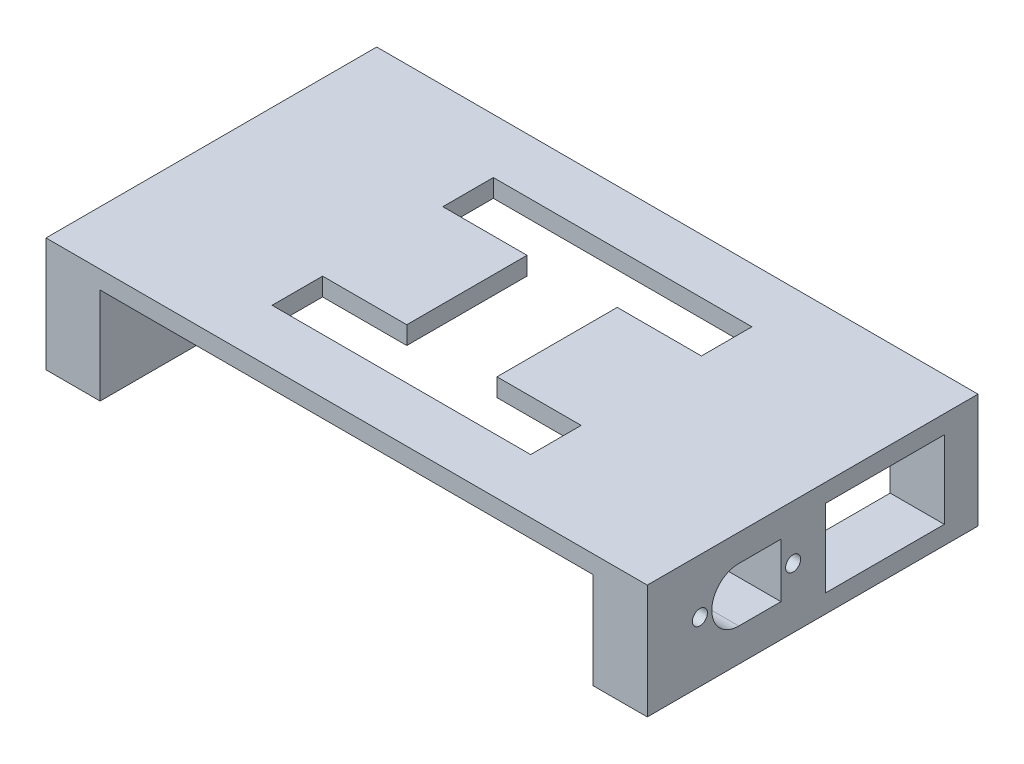
ISO-10303-21;
HEADER;
FILE_DESCRIPTION(('STEP AP214'),'2;1');
FILE_NAME('part.step','',(''),(''),'','','');
FILE_SCHEMA(('AUTOMOTIVE_DESIGN { 1 0 10303 214 1 1 1 1 }'));
ENDSEC;
DATA;
#1=APPLICATION_CONTEXT('core data for automotive mechanical design processes');
#2=APPLICATION_PROTOCOL_DEFINITION('international standard','automotive_design',2000,#1);
#3=PRODUCT_CONTEXT('',#1,'mechanical');
#4=PRODUCT('Part','Part','',(#3));
#5=PRODUCT_RELATED_PRODUCT_CATEGORY('part','',(#4));
#6=PRODUCT_DEFINITION_FORMATION('','',#4);
#7=PRODUCT_DEFINITION_CONTEXT('part definition',#1,'design');
#8=PRODUCT_DEFINITION('design','',#6,#7);
#9=PRODUCT_DEFINITION_SHAPE('','',#8);
#10=(LENGTH_UNIT() NAMED_UNIT(*) SI_UNIT(.MILLI.,.METRE.));
#11=(NAMED_UNIT(*) PLANE_ANGLE_UNIT() SI_UNIT($,.RADIAN.));
#12=(NAMED_UNIT(*) SI_UNIT($,.STERADIAN.) SOLID_ANGLE_UNIT());
#13=UNCERTAINTY_MEASURE_WITH_UNIT(LENGTH_MEASURE(1.E-05),#10,'distance_accuracy_value','');
#14=(GEOMETRIC_REPRESENTATION_CONTEXT(3) GLOBAL_UNCERTAINTY_ASSIGNED_CONTEXT((#13)) GLOBAL_UNIT_ASSIGNED_CONTEXT((#10,
#11,#12)) REPRESENTATION_CONTEXT('',''));
#15=CARTESIAN_POINT('',(0.,0.,0.));
#16=DIRECTION('',(0.,0.,1.));
#17=DIRECTION('',(1.,0.,0.));
#18=AXIS2_PLACEMENT_3D('',#15,#16,#17);
#19=CARTESIAN_POINT('',(21.5,-0.001000000000001,9.99999999999999));
#20=DIRECTION('',(0.,0.,-1.));
#21=DIRECTION('',(-1.,0.,0.));
#22=AXIS2_PLACEMENT_3D('',#19,#20,#21);
#23=PLANE('',#22);
#24=DIRECTION('',(-1.,0.,0.));
#25=VECTOR('',#24,1.);
#26=CARTESIAN_POINT('',(21.5,19.,9.99999999999999));
#27=LINE('',#26,#25);
#28=CARTESIAN_POINT('',(21.5,19.,9.99999999999999));
#29=VERTEX_POINT('',#28);
#30=CARTESIAN_POINT('',(7.5,19.,9.99999999999998));
#31=VERTEX_POINT('',#30);
#32=EDGE_CURVE('E287',#29,#31,#27,.T.);
#33=ORIENTED_EDGE('',*,*,#32,.T.);
#34=DIRECTION('',(0.,1.,0.));
#35=VECTOR('',#34,1.);
#36=CARTESIAN_POINT('',(7.5,-0.001000000000001,9.99999999999998));
#37=LINE('',#36,#35);
#38=CARTESIAN_POINT('',(7.5,16.,9.99999999999998));
#39=VERTEX_POINT('',#38);
#40=EDGE_CURVE('E271',#39,#31,#37,.T.);
#41=ORIENTED_EDGE('',*,*,#40,.F.);
#42=DIRECTION('',(1.,0.,0.));
#43=VECTOR('',#42,1.);
#44=CARTESIAN_POINT('',(21.5,16.,9.99999999999999));
#45=LINE('',#44,#43);
#46=CARTESIAN_POINT('',(21.5,16.,9.99999999999999));
#47=VERTEX_POINT('',#46);
#48=EDGE_CURVE('E234',#39,#47,#45,.T.);
#49=ORIENTED_EDGE('',*,*,#48,.T.);
#50=DIRECTION('',(0.,1.,0.));
#51=VECTOR('',#50,1.);
#52=CARTESIAN_POINT('',(21.5,-0.001000000000001,9.99999999999999));
#53=LINE('',#52,#51);
#54=EDGE_CURVE('E295',#47,#29,#53,.T.);
#55=ORIENTED_EDGE('',*,*,#54,.T.);
#56=EDGE_LOOP('',(#33,#41,#49,#55));
#57=FACE_BOUND('',#56,.T.);
#58=ADVANCED_FACE('F33',(#57),#23,.F.);
#59=CARTESIAN_POINT('',(21.5,-0.001000000000001,-9.99999999999999));
#60=DIRECTION('',(0.,0.,1.));
#61=DIRECTION('',(1.,0.,0.));
#62=AXIS2_PLACEMENT_3D('',#59,#60,#61);
#63=PLANE('',#62);
#64=DIRECTION('',(-1.,0.,0.));
#65=VECTOR('',#64,1.);
#66=CARTESIAN_POINT('',(21.5,16.,-9.99999999999999));
#67=LINE('',#66,#65);
#68=CARTESIAN_POINT('',(21.5,16.,-9.99999999999999));
#69=VERTEX_POINT('',#68);
#70=CARTESIAN_POINT('',(7.5,16.,-9.99999999999998));
#71=VERTEX_POINT('',#70);
#72=EDGE_CURVE('E232',#69,#71,#67,.T.);
#73=ORIENTED_EDGE('',*,*,#72,.T.);
#74=DIRECTION('',(0.,1.,0.));
#75=VECTOR('',#74,1.);
#76=CARTESIAN_POINT('',(7.5,-0.001000000000001,-9.99999999999998));
#77=LINE('',#76,#75);
#78=CARTESIAN_POINT('',(7.5,19.,-9.99999999999998));
#79=VERTEX_POINT('',#78);
#80=EDGE_CURVE('E215',#71,#79,#77,.T.);
#81=ORIENTED_EDGE('',*,*,#80,.T.);
#82=DIRECTION('',(1.,0.,0.));
#83=VECTOR('',#82,1.);
#84=CARTESIAN_POINT('',(21.5,19.,-9.99999999999999));
#85=LINE('',#84,#83);
#86=CARTESIAN_POINT('',(21.5,19.,-9.99999999999999));
#87=VERTEX_POINT('',#86);
#88=EDGE_CURVE('E240',#79,#87,#85,.T.);
#89=ORIENTED_EDGE('',*,*,#88,.T.);
#90=DIRECTION('',(0.,1.,0.));
#91=VECTOR('',#90,1.);
#92=CARTESIAN_POINT('',(21.5,-0.001000000000001,-9.99999999999999));
#93=LINE('',#92,#91);
#94=EDGE_CURVE('E238',#69,#87,#93,.T.);
#95=ORIENTED_EDGE('',*,*,#94,.F.);
#96=EDGE_LOOP('',(#73,#81,#89,#95));
#97=FACE_BOUND('',#96,.T.);
#98=ADVANCED_FACE('F236',(#97),#63,.F.);
#99=CARTESIAN_POINT('',(0.,0.,0.));
#100=DIRECTION('',(0.,-1.,0.));
#101=DIRECTION('',(0.,0.,-1.));
#102=AXIS2_PLACEMENT_3D('',#99,#100,#101);
#103=PLANE('',#102);
#104=DIRECTION('',(0.,0.,1.));
#105=VECTOR('',#104,1.);
#106=CARTESIAN_POINT('',(41.,0.,0.));
#107=LINE('',#106,#105);
#108=CARTESIAN_POINT('',(41.,0.,-27.5));
#109=VERTEX_POINT('',#108);
#110=CARTESIAN_POINT('',(41.,0.,27.5));
#111=VERTEX_POINT('',#110);
#112=EDGE_CURVE('E41',#109,#111,#107,.T.);
#113=ORIENTED_EDGE('',*,*,#112,.F.);
#114=DIRECTION('',(-1.,0.,0.));
#115=VECTOR('',#114,1.);
#116=CARTESIAN_POINT('',(-50.,0.,-27.5));
#117=LINE('',#116,#115);
#118=CARTESIAN_POINT('',(50.,0.,-27.5));
#119=VERTEX_POINT('',#118);
#120=EDGE_CURVE('E413',#119,#109,#117,.T.);
#121=ORIENTED_EDGE('',*,*,#120,.F.);
#122=DIRECTION('',(0.,0.,-1.));
#123=VECTOR('',#122,1.);
#124=CARTESIAN_POINT('',(50.,0.,27.5));
#125=LINE('',#124,#123);
#126=CARTESIAN_POINT('',(50.,0.,27.5));
#127=VERTEX_POINT('',#126);
#128=EDGE_CURVE('E398',#127,#119,#125,.T.);
#129=ORIENTED_EDGE('',*,*,#128,.F.);
#130=DIRECTION('',(1.,0.,0.));
#131=VECTOR('',#130,1.);
#132=CARTESIAN_POINT('',(-50.,0.,27.5));
#133=LINE('',#132,#131);
#134=EDGE_CURVE('E418',#111,#127,#133,.T.);
#135=ORIENTED_EDGE('',*,*,#134,.F.);
#136=EDGE_LOOP('',(#113,#121,#129,#135));
#137=FACE_BOUND('',#136,.T.);
#138=ADVANCED_FACE('F443',(#137),#103,.T.);
#139=CARTESIAN_POINT('',(50.,19.,27.5));
#140=DIRECTION('',(-1.,0.,0.));
#141=DIRECTION('',(0.,0.,1.));
#142=AXIS2_PLACEMENT_3D('',#139,#140,#141);
#143=PLANE('',#142);
#144=DIRECTION('',(0.,0.,1.));
#145=VECTOR('',#144,1.);
#146=CARTESIAN_POINT('',(50.,15.95,-2.10000000000003));
#147=LINE('',#146,#145);
#148=CARTESIAN_POINT('',(50.,15.95,-21.9));
#149=VERTEX_POINT('',#148);
#150=CARTESIAN_POINT('',(50.,15.95,-2.10000000000003));
#151=VERTEX_POINT('',#150);
#152=EDGE_CURVE('E313',#149,#151,#147,.T.);
#153=ORIENTED_EDGE('',*,*,#152,.F.);
#154=DIRECTION('',(0.,1.,0.));
#155=VECTOR('',#154,1.);
#156=CARTESIAN_POINT('',(50.,3.05,-21.9));
#157=LINE('',#156,#155);
#158=CARTESIAN_POINT('',(50.,3.05,-21.9));
#159=VERTEX_POINT('',#158);
#160=EDGE_CURVE('E311',#159,#149,#157,.T.);
#161=ORIENTED_EDGE('',*,*,#160,.F.);
#162=DIRECTION('',(0.,0.,-1.));
#163=VECTOR('',#162,1.);
#164=CARTESIAN_POINT('',(50.,3.05,-2.10000000000003));
#165=LINE('',#164,#163);
#166=CARTESIAN_POINT('',(50.,3.05,-2.10000000000003));
#167=VERTEX_POINT('',#166);
#168=EDGE_CURVE('E319',#167,#159,#165,.T.);
#169=ORIENTED_EDGE('',*,*,#168,.F.);
#170=DIRECTION('',(0.,-1.,0.));
#171=VECTOR('',#170,1.);
#172=CARTESIAN_POINT('',(50.,3.05,-2.10000000000003));
#173=LINE('',#172,#171);
#174=EDGE_CURVE('E316',#151,#167,#173,.T.);
#175=ORIENTED_EDGE('',*,*,#174,.F.);
#176=EDGE_LOOP('',(#153,#161,#169,#175));
#177=FACE_BOUND('',#176,.T.);
#178=CARTESIAN_POINT('',(50.,10.,3.25));
#179=DIRECTION('',(1.,0.,0.));
#180=DIRECTION('',(0.,0.,1.));
#181=AXIS2_PLACEMENT_3D('',#178,#179,#180);
#182=CIRCLE('',#181,1.25);
#183=CARTESIAN_POINT('',(50.,10.,4.5));
#184=VERTEX_POINT('',#183);
#185=EDGE_CURVE('E334',#184,#184,#182,.T.);
#186=ORIENTED_EDGE('',*,*,#185,.F.);
#187=EDGE_LOOP('',(#186));
#188=FACE_BOUND('',#187,.T.);
#189=CARTESIAN_POINT('',(50.,9.99999999999999,18.75));
#190=DIRECTION('',(1.,0.,0.));
#191=DIRECTION('',(0.,0.,-1.));
#192=AXIS2_PLACEMENT_3D('',#189,#190,#191);
#193=CIRCLE('',#192,1.24999999999999);
#194=CARTESIAN_POINT('',(50.,9.99999999999999,17.5));
#195=VERTEX_POINT('',#194);
#196=EDGE_CURVE('E335',#195,#195,#193,.T.);
#197=ORIENTED_EDGE('',*,*,#196,.F.);
#198=EDGE_LOOP('',(#197));
#199=FACE_BOUND('',#198,.T.);
#200=DIRECTION('',(0.,1.,0.));
#201=VECTOR('',#200,1.);
#202=CARTESIAN_POINT('',(50.,5.50000000000002,5.27272727272726));
#203=LINE('',#202,#201);
#204=CARTESIAN_POINT('',(50.,5.50000000000002,5.27272727272726));
#205=VERTEX_POINT('',#204);
#206=CARTESIAN_POINT('',(50.,14.5,5.27272727272729));
#207=VERTEX_POINT('',#206);
#208=EDGE_CURVE('E356',#205,#207,#203,.T.);
#209=ORIENTED_EDGE('',*,*,#208,.F.);
#210=DIRECTION('',(0.,0.,-1.));
#211=VECTOR('',#210,1.);
#212=CARTESIAN_POINT('',(50.,5.50000000000002,5.27272727272726));
#213=LINE('',#212,#211);
#214=CARTESIAN_POINT('',(50.,5.5,12.2784090909091));
#215=VERTEX_POINT('',#214);
#216=EDGE_CURVE('E354',#215,#205,#213,.T.);
#217=ORIENTED_EDGE('',*,*,#216,.F.);
#218=CARTESIAN_POINT('',(50.,10.,12.2784090909091));
#219=DIRECTION('',(1.,0.,0.));
#220=DIRECTION('',(0.,0.,1.));
#221=AXIS2_PLACEMENT_3D('',#218,#219,#220);
#222=CIRCLE('',#221,4.5);
#223=CARTESIAN_POINT('',(50.,14.5,12.2784090909091));
#224=VERTEX_POINT('',#223);
#225=EDGE_CURVE('E362',#224,#215,#222,.T.);
#226=ORIENTED_EDGE('',*,*,#225,.F.);
#227=DIRECTION('',(0.,0.,1.));
#228=VECTOR('',#227,1.);
#229=CARTESIAN_POINT('',(50.,14.5,5.27272727272729));
#230=LINE('',#229,#228);
#231=EDGE_CURVE('E359',#207,#224,#230,.T.);
#232=ORIENTED_EDGE('',*,*,#231,.F.);
#233=EDGE_LOOP('',(#209,#217,#226,#232));
#234=FACE_BOUND('',#233,.T.);
#235=ORIENTED_EDGE('',*,*,#128,.T.);
#236=DIRECTION('',(0.,-1.,0.));
#237=VECTOR('',#236,1.);
#238=CARTESIAN_POINT('',(50.,19.,-27.5));
#239=LINE('',#238,#237);
#240=CARTESIAN_POINT('',(50.,19.,-27.5));
#241=VERTEX_POINT('',#240);
#242=EDGE_CURVE('E429',#241,#119,#239,.T.);
#243=ORIENTED_EDGE('',*,*,#242,.F.);
#244=DIRECTION('',(0.,0.,-1.));
#245=VECTOR('',#244,1.);
#246=CARTESIAN_POINT('',(50.,19.,27.5));
#247=LINE('',#246,#245);
#248=CARTESIAN_POINT('',(50.,19.,27.5));
#249=VERTEX_POINT('',#248);
#250=EDGE_CURVE('E399',#249,#241,#247,.T.);
#251=ORIENTED_EDGE('',*,*,#250,.F.);
#252=DIRECTION('',(0.,-1.,0.));
#253=VECTOR('',#252,1.);
#254=CARTESIAN_POINT('',(50.,19.,27.5));
#255=LINE('',#254,#253);
#256=EDGE_CURVE('E409',#249,#127,#255,.T.);
#257=ORIENTED_EDGE('',*,*,#256,.T.);
#258=EDGE_LOOP('',(#235,#243,#251,#257));
#259=FACE_BOUND('',#258,.T.);
#260=ADVANCED_FACE('F35',(#177,#188,#199,#234,#259),#143,.F.);
#261=CARTESIAN_POINT('',(-50.,19.,-27.5));
#262=DIRECTION('',(0.,0.,1.));
#263=DIRECTION('',(1.,0.,0.));
#264=AXIS2_PLACEMENT_3D('',#261,#262,#263);
#265=PLANE('',#264);
#266=ORIENTED_EDGE('',*,*,#120,.T.);
#267=DIRECTION('',(0.,1.,0.));
#268=VECTOR('',#267,1.);
#269=CARTESIAN_POINT('',(41.,19.,-27.5));
#270=LINE('',#269,#268);
#271=CARTESIAN_POINT('',(41.,16.,-27.5));
#272=VERTEX_POINT('',#271);
#273=EDGE_CURVE('E392',#109,#272,#270,.T.);
#274=ORIENTED_EDGE('',*,*,#273,.T.);
#275=DIRECTION('',(-1.,0.,0.));
#276=VECTOR('',#275,1.);
#277=CARTESIAN_POINT('',(-50.,16.,-27.5));
#278=LINE('',#277,#276);
#279=CARTESIAN_POINT('',(-41.,16.,-27.5));
#280=VERTEX_POINT('',#279);
#281=EDGE_CURVE('E395',#272,#280,#278,.T.);
#282=ORIENTED_EDGE('',*,*,#281,.T.);
#283=DIRECTION('',(0.,-1.,0.));
#284=VECTOR('',#283,1.);
#285=CARTESIAN_POINT('',(-41.,19.,-27.5));
#286=LINE('',#285,#284);
#287=CARTESIAN_POINT('',(-41.,0.,-27.5));
#288=VERTEX_POINT('',#287);
#289=EDGE_CURVE('E386',#280,#288,#286,.T.);
#290=ORIENTED_EDGE('',*,*,#289,.T.);
#291=CARTESIAN_POINT('',(-50.,0.,-27.5));
#292=VERTEX_POINT('',#291);
#293=EDGE_CURVE('E412',#288,#292,#117,.T.);
#294=ORIENTED_EDGE('',*,*,#293,.T.);
#295=DIRECTION('',(0.,-1.,0.));
#296=VECTOR('',#295,1.);
#297=CARTESIAN_POINT('',(-50.,19.,-27.5));
#298=LINE('',#297,#296);
#299=CARTESIAN_POINT('',(-50.,19.,-27.5));
#300=VERTEX_POINT('',#299);
#301=EDGE_CURVE('E426',#300,#292,#298,.T.);
#302=ORIENTED_EDGE('',*,*,#301,.F.);
#303=DIRECTION('',(-1.,0.,0.));
#304=VECTOR('',#303,1.);
#305=CARTESIAN_POINT('',(-50.,19.,-27.5));
#306=LINE('',#305,#304);
#307=EDGE_CURVE('E402',#241,#300,#306,.T.);
#308=ORIENTED_EDGE('',*,*,#307,.F.);
#309=ORIENTED_EDGE('',*,*,#242,.T.);
#310=EDGE_LOOP('',(#266,#274,#282,#290,#294,#302,#308,#309));
#311=FACE_BOUND('',#310,.T.);
#312=ADVANCED_FACE('F465',(#311),#265,.F.);
#313=CARTESIAN_POINT('',(-50.,19.,27.5));
#314=DIRECTION('',(1.,0.,0.));
#315=DIRECTION('',(0.,0.,-1.));
#316=AXIS2_PLACEMENT_3D('',#313,#314,#315);
#317=PLANE('',#316);
#318=DIRECTION('',(0.,0.,1.));
#319=VECTOR('',#318,1.);
#320=CARTESIAN_POINT('',(-50.,0.,27.5));
#321=LINE('',#320,#319);
#322=CARTESIAN_POINT('',(-50.,0.,27.5));
#323=VERTEX_POINT('',#322);
#324=EDGE_CURVE('E416',#292,#323,#321,.T.);
#325=ORIENTED_EDGE('',*,*,#324,.T.);
#326=DIRECTION('',(0.,-1.,0.));
#327=VECTOR('',#326,1.);
#328=CARTESIAN_POINT('',(-50.,19.,27.5));
#329=LINE('',#328,#327);
#330=CARTESIAN_POINT('',(-50.,19.,27.5));
#331=VERTEX_POINT('',#330);
#332=EDGE_CURVE('E423',#331,#323,#329,.T.);
#333=ORIENTED_EDGE('',*,*,#332,.F.);
#334=DIRECTION('',(0.,0.,1.));
#335=VECTOR('',#334,1.);
#336=CARTESIAN_POINT('',(-50.,19.,27.5));
#337=LINE('',#336,#335);
#338=EDGE_CURVE('E405',#300,#331,#337,.T.);
#339=ORIENTED_EDGE('',*,*,#338,.F.);
#340=ORIENTED_EDGE('',*,*,#301,.T.);
#341=EDGE_LOOP('',(#325,#333,#339,#340));
#342=FACE_BOUND('',#341,.T.);
#343=ADVANCED_FACE('F455',(#342),#317,.F.);
#344=CARTESIAN_POINT('',(-50.,19.,27.5));
#345=DIRECTION('',(0.,0.,-1.));
#346=DIRECTION('',(-1.,0.,0.));
#347=AXIS2_PLACEMENT_3D('',#344,#345,#346);
#348=PLANE('',#347);
#349=DIRECTION('',(1.,0.,0.));
#350=VECTOR('',#349,1.);
#351=CARTESIAN_POINT('',(-50.,16.,27.5));
#352=LINE('',#351,#350);
#353=CARTESIAN_POINT('',(-41.,16.,27.5));
#354=VERTEX_POINT('',#353);
#355=CARTESIAN_POINT('',(41.,16.,27.5));
#356=VERTEX_POINT('',#355);
#357=EDGE_CURVE('E11',#354,#356,#352,.T.);
#358=ORIENTED_EDGE('',*,*,#357,.T.);
#359=DIRECTION('',(0.,-1.,0.));
#360=VECTOR('',#359,1.);
#361=CARTESIAN_POINT('',(41.,19.,27.5));
#362=LINE('',#361,#360);
#363=EDGE_CURVE('E389',#356,#111,#362,.T.);
#364=ORIENTED_EDGE('',*,*,#363,.T.);
#365=ORIENTED_EDGE('',*,*,#134,.T.);
#366=ORIENTED_EDGE('',*,*,#256,.F.);
#367=DIRECTION('',(1.,0.,0.));
#368=VECTOR('',#367,1.);
#369=CARTESIAN_POINT('',(-50.,19.,27.5));
#370=LINE('',#369,#368);
#371=EDGE_CURVE('E407',#331,#249,#370,.T.);
#372=ORIENTED_EDGE('',*,*,#371,.F.);
#373=ORIENTED_EDGE('',*,*,#332,.T.);
#374=CARTESIAN_POINT('',(-41.,0.,27.5));
#375=VERTEX_POINT('',#374);
#376=EDGE_CURVE('E403',#323,#375,#133,.T.);
#377=ORIENTED_EDGE('',*,*,#376,.T.);
#378=DIRECTION('',(0.,1.,0.));
#379=VECTOR('',#378,1.);
#380=CARTESIAN_POINT('',(-41.,19.,27.5));
#381=LINE('',#380,#379);
#382=EDGE_CURVE('E383',#375,#354,#381,.T.);
#383=ORIENTED_EDGE('',*,*,#382,.T.);
#384=EDGE_LOOP('',(#358,#364,#365,#366,#372,#373,#377,#383));
#385=FACE_BOUND('',#384,.T.);
#386=ADVANCED_FACE('F440',(#385),#348,.F.);
#387=CARTESIAN_POINT('',(0.,19.,0.));
#388=DIRECTION('',(0.,-1.,0.));
#389=DIRECTION('',(0.,0.,-1.));
#390=AXIS2_PLACEMENT_3D('',#387,#388,#389);
#391=PLANE('',#390);
#392=ORIENTED_EDGE('',*,*,#88,.F.);
#393=DIRECTION('',(0.,0.,-1.));
#394=VECTOR('',#393,1.);
#395=CARTESIAN_POINT('',(7.5,19.,9.99999999999998));
#396=LINE('',#395,#394);
#397=EDGE_CURVE('E48',#31,#79,#396,.T.);
#398=ORIENTED_EDGE('',*,*,#397,.F.);
#399=ORIENTED_EDGE('',*,*,#32,.F.);
#400=DIRECTION('',(0.,0.,-1.));
#401=VECTOR('',#400,1.);
#402=CARTESIAN_POINT('',(21.5,19.,9.99999999999999));
#403=LINE('',#402,#401);
#404=CARTESIAN_POINT('',(21.5,19.,18.4));
#405=VERTEX_POINT('',#404);
#406=EDGE_CURVE('E283',#405,#29,#403,.T.);
#407=ORIENTED_EDGE('',*,*,#406,.F.);
#408=DIRECTION('',(1.,0.,0.));
#409=VECTOR('',#408,1.);
#410=CARTESIAN_POINT('',(21.5,19.,18.4));
#411=LINE('',#410,#409);
#412=CARTESIAN_POINT('',(-21.5,19.,18.4));
#413=VERTEX_POINT('',#412);
#414=EDGE_CURVE('E280',#413,#405,#411,.T.);
#415=ORIENTED_EDGE('',*,*,#414,.F.);
#416=DIRECTION('',(0.,0.,1.));
#417=VECTOR('',#416,1.);
#418=CARTESIAN_POINT('',(-21.5,19.,10.));
#419=LINE('',#418,#417);
#420=CARTESIAN_POINT('',(-21.5,19.,10.));
#421=VERTEX_POINT('',#420);
#422=EDGE_CURVE('E278',#421,#413,#419,.T.);
#423=ORIENTED_EDGE('',*,*,#422,.F.);
#424=CARTESIAN_POINT('',(-7.5,19.,9.99999999999998));
#425=VERTEX_POINT('',#424);
#426=EDGE_CURVE('E286',#425,#421,#27,.T.);
#427=ORIENTED_EDGE('',*,*,#426,.F.);
#428=DIRECTION('',(0.,0.,1.));
#429=VECTOR('',#428,1.);
#430=CARTESIAN_POINT('',(-7.5,19.,9.99999999999998));
#431=LINE('',#430,#429);
#432=CARTESIAN_POINT('',(-7.5,19.,-9.99999999999998));
#433=VERTEX_POINT('',#432);
#434=EDGE_CURVE('E224',#433,#425,#431,.T.);
#435=ORIENTED_EDGE('',*,*,#434,.F.);
#436=CARTESIAN_POINT('',(-21.5,19.,-9.99999999999998));
#437=VERTEX_POINT('',#436);
#438=EDGE_CURVE('E243',#437,#433,#85,.T.);
#439=ORIENTED_EDGE('',*,*,#438,.F.);
#440=DIRECTION('',(0.,0.,1.));
#441=VECTOR('',#440,1.);
#442=CARTESIAN_POINT('',(-21.5,19.,-9.99999999999998));
#443=LINE('',#442,#441);
#444=CARTESIAN_POINT('',(-21.5,19.,-18.4));
#445=VERTEX_POINT('',#444);
#446=EDGE_CURVE('E256',#445,#437,#443,.T.);
#447=ORIENTED_EDGE('',*,*,#446,.F.);
#448=DIRECTION('',(-1.,0.,0.));
#449=VECTOR('',#448,1.);
#450=CARTESIAN_POINT('',(21.5,19.,-18.4));
#451=LINE('',#450,#449);
#452=CARTESIAN_POINT('',(21.5,19.,-18.4));
#453=VERTEX_POINT('',#452);
#454=EDGE_CURVE('E253',#453,#445,#451,.T.);
#455=ORIENTED_EDGE('',*,*,#454,.F.);
#456=DIRECTION('',(0.,0.,-1.));
#457=VECTOR('',#456,1.);
#458=CARTESIAN_POINT('',(21.5,19.,-9.99999999999999));
#459=LINE('',#458,#457);
#460=EDGE_CURVE('E250',#87,#453,#459,.T.);
#461=ORIENTED_EDGE('',*,*,#460,.F.);
#462=EDGE_LOOP('',(#392,#398,#399,#407,#415,#423,#427,#435,#439,#447,#455,#461));
#463=FACE_BOUND('',#462,.T.);
#464=ORIENTED_EDGE('',*,*,#250,.T.);
#465=ORIENTED_EDGE('',*,*,#307,.T.);
#466=ORIENTED_EDGE('',*,*,#338,.T.);
#467=ORIENTED_EDGE('',*,*,#371,.T.);
#468=EDGE_LOOP('',(#464,#465,#466,#467));
#469=FACE_BOUND('',#468,.T.);
#470=ADVANCED_FACE('F451',(#463,#469),#391,.F.);
#471=DIRECTION('',(0.,0.,-1.));
#472=VECTOR('',#471,1.);
#473=CARTESIAN_POINT('',(-41.,0.,0.));
#474=LINE('',#473,#472);
#475=EDGE_CURVE('E432',#375,#288,#474,.T.);
#476=ORIENTED_EDGE('',*,*,#475,.F.);
#477=ORIENTED_EDGE('',*,*,#376,.F.);
#478=ORIENTED_EDGE('',*,*,#324,.F.);
#479=ORIENTED_EDGE('',*,*,#293,.F.);
#480=EDGE_LOOP('',(#476,#477,#478,#479));
#481=FACE_BOUND('',#480,.T.);
#482=ADVANCED_FACE('F460',(#481),#103,.T.);
#483=CARTESIAN_POINT('',(0.,16.,0.));
#484=DIRECTION('',(0.,1.,0.));
#485=DIRECTION('',(0.,0.,1.));
#486=AXIS2_PLACEMENT_3D('',#483,#484,#485);
#487=PLANE('',#486);
#488=ORIENTED_EDGE('',*,*,#48,.F.);
#489=DIRECTION('',(0.,0.,1.));
#490=VECTOR('',#489,1.);
#491=CARTESIAN_POINT('',(7.5,16.,9.99999999999998));
#492=LINE('',#491,#490);
#493=EDGE_CURVE('E218',#71,#39,#492,.T.);
#494=ORIENTED_EDGE('',*,*,#493,.F.);
#495=ORIENTED_EDGE('',*,*,#72,.F.);
#496=DIRECTION('',(0.,0.,1.));
#497=VECTOR('',#496,1.);
#498=CARTESIAN_POINT('',(21.5,16.,-9.99999999999999));
#499=LINE('',#498,#497);
#500=CARTESIAN_POINT('',(21.5,16.,-18.4));
#501=VERTEX_POINT('',#500);
#502=EDGE_CURVE('E261',#501,#69,#499,.T.);
#503=ORIENTED_EDGE('',*,*,#502,.F.);
#504=DIRECTION('',(1.,0.,0.));
#505=VECTOR('',#504,1.);
#506=CARTESIAN_POINT('',(21.5,16.,-18.4));
#507=LINE('',#506,#505);
#508=CARTESIAN_POINT('',(-21.5,16.,-18.4));
#509=VERTEX_POINT('',#508);
#510=EDGE_CURVE('E303',#509,#501,#507,.T.);
#511=ORIENTED_EDGE('',*,*,#510,.F.);
#512=DIRECTION('',(0.,0.,-1.));
#513=VECTOR('',#512,1.);
#514=CARTESIAN_POINT('',(-21.5,16.,-9.99999999999998));
#515=LINE('',#514,#513);
#516=CARTESIAN_POINT('',(-21.5,16.,-9.99999999999998));
#517=VERTEX_POINT('',#516);
#518=EDGE_CURVE('E245',#517,#509,#515,.T.);
#519=ORIENTED_EDGE('',*,*,#518,.F.);
#520=CARTESIAN_POINT('',(-7.5,16.,-9.99999999999998));
#521=VERTEX_POINT('',#520);
#522=EDGE_CURVE('E241',#521,#517,#67,.T.);
#523=ORIENTED_EDGE('',*,*,#522,.F.);
#524=DIRECTION('',(0.,0.,-1.));
#525=VECTOR('',#524,1.);
#526=CARTESIAN_POINT('',(-7.5,16.,9.99999999999998));
#527=LINE('',#526,#525);
#528=CARTESIAN_POINT('',(-7.5,16.,9.99999999999998));
#529=VERTEX_POINT('',#528);
#530=EDGE_CURVE('E56',#529,#521,#527,.T.);
#531=ORIENTED_EDGE('',*,*,#530,.F.);
#532=CARTESIAN_POINT('',(-21.5,16.,10.));
#533=VERTEX_POINT('',#532);
#534=EDGE_CURVE('E272',#533,#529,#45,.T.);
#535=ORIENTED_EDGE('',*,*,#534,.F.);
#536=DIRECTION('',(0.,0.,-1.));
#537=VECTOR('',#536,1.);
#538=CARTESIAN_POINT('',(-21.5,16.,10.));
#539=LINE('',#538,#537);
#540=CARTESIAN_POINT('',(-21.5,16.,18.4));
#541=VERTEX_POINT('',#540);
#542=EDGE_CURVE('E275',#541,#533,#539,.T.);
#543=ORIENTED_EDGE('',*,*,#542,.F.);
#544=DIRECTION('',(-1.,0.,0.));
#545=VECTOR('',#544,1.);
#546=CARTESIAN_POINT('',(21.5,16.,18.4));
#547=LINE('',#546,#545);
#548=CARTESIAN_POINT('',(21.5,16.,18.4));
#549=VERTEX_POINT('',#548);
#550=EDGE_CURVE('E294',#549,#541,#547,.T.);
#551=ORIENTED_EDGE('',*,*,#550,.F.);
#552=DIRECTION('',(0.,0.,1.));
#553=VECTOR('',#552,1.);
#554=CARTESIAN_POINT('',(21.5,16.,9.99999999999999));
#555=LINE('',#554,#553);
#556=EDGE_CURVE('E269',#47,#549,#555,.T.);
#557=ORIENTED_EDGE('',*,*,#556,.F.);
#558=EDGE_LOOP('',(#488,#494,#495,#503,#511,#519,#523,#531,#535,#543,#551,#557));
#559=FACE_BOUND('',#558,.T.);
#560=DIRECTION('',(0.,0.,1.));
#561=VECTOR('',#560,1.);
#562=CARTESIAN_POINT('',(41.,16.,-45.5));
#563=LINE('',#562,#561);
#564=EDGE_CURVE('E377',#272,#356,#563,.T.);
#565=ORIENTED_EDGE('',*,*,#564,.T.);
#566=ORIENTED_EDGE('',*,*,#357,.F.);
#567=DIRECTION('',(0.,0.,-1.));
#568=VECTOR('',#567,1.);
#569=CARTESIAN_POINT('',(-41.,16.,-45.5));
#570=LINE('',#569,#568);
#571=EDGE_CURVE('E380',#354,#280,#570,.T.);
#572=ORIENTED_EDGE('',*,*,#571,.T.);
#573=ORIENTED_EDGE('',*,*,#281,.F.);
#574=EDGE_LOOP('',(#565,#566,#572,#573));
#575=FACE_BOUND('',#574,.T.);
#576=ADVANCED_FACE('F229',(#559,#575),#487,.F.);
#577=CARTESIAN_POINT('',(41.,16.,-45.5));
#578=DIRECTION('',(1.,0.,0.));
#579=DIRECTION('',(0.,0.,-1.));
#580=AXIS2_PLACEMENT_3D('',#577,#578,#579);
#581=PLANE('',#580);
#582=DIRECTION('',(0.,0.,1.));
#583=VECTOR('',#582,1.);
#584=CARTESIAN_POINT('',(41.,3.05,-2.10000000000003));
#585=LINE('',#584,#583);
#586=CARTESIAN_POINT('',(41.,3.05,-21.9));
#587=VERTEX_POINT('',#586);
#588=CARTESIAN_POINT('',(41.,3.05,-2.10000000000003));
#589=VERTEX_POINT('',#588);
#590=EDGE_CURVE('E305',#587,#589,#585,.T.);
#591=ORIENTED_EDGE('',*,*,#590,.F.);
#592=DIRECTION('',(0.,-1.,0.));
#593=VECTOR('',#592,1.);
#594=CARTESIAN_POINT('',(41.,3.05,-21.9));
#595=LINE('',#594,#593);
#596=CARTESIAN_POINT('',(41.,15.95,-21.9));
#597=VERTEX_POINT('',#596);
#598=EDGE_CURVE('E308',#597,#587,#595,.T.);
#599=ORIENTED_EDGE('',*,*,#598,.F.);
#600=DIRECTION('',(0.,0.,-1.));
#601=VECTOR('',#600,1.);
#602=CARTESIAN_POINT('',(41.,15.95,-2.10000000000003));
#603=LINE('',#602,#601);
#604=CARTESIAN_POINT('',(41.,15.95,-2.10000000000003));
#605=VERTEX_POINT('',#604);
#606=EDGE_CURVE('E325',#605,#597,#603,.T.);
#607=ORIENTED_EDGE('',*,*,#606,.F.);
#608=DIRECTION('',(0.,1.,0.));
#609=VECTOR('',#608,1.);
#610=CARTESIAN_POINT('',(41.,3.05,-2.10000000000003));
#611=LINE('',#610,#609);
#612=EDGE_CURVE('E268',#589,#605,#611,.T.);
#613=ORIENTED_EDGE('',*,*,#612,.F.);
#614=EDGE_LOOP('',(#591,#599,#607,#613));
#615=FACE_BOUND('',#614,.T.);
#616=CARTESIAN_POINT('',(41.,10.,3.25));
#617=DIRECTION('',(1.,0.,0.));
#618=DIRECTION('',(0.,0.,-1.));
#619=AXIS2_PLACEMENT_3D('',#616,#617,#618);
#620=CIRCLE('',#619,1.25);
#621=CARTESIAN_POINT('',(41.,10.,2.));
#622=VERTEX_POINT('',#621);
#623=EDGE_CURVE('E339',#622,#622,#620,.F.);
#624=ORIENTED_EDGE('',*,*,#623,.F.);
#625=EDGE_LOOP('',(#624));
#626=FACE_BOUND('',#625,.T.);
#627=CARTESIAN_POINT('',(41.,9.99999999999999,18.75));
#628=DIRECTION('',(1.,0.,0.));
#629=DIRECTION('',(0.,0.,-1.));
#630=AXIS2_PLACEMENT_3D('',#627,#628,#629);
#631=CIRCLE('',#630,1.24999999999999);
#632=CARTESIAN_POINT('',(41.,9.99999999999999,17.5));
#633=VERTEX_POINT('',#632);
#634=EDGE_CURVE('E338',#633,#633,#631,.F.);
#635=ORIENTED_EDGE('',*,*,#634,.F.);
#636=EDGE_LOOP('',(#635));
#637=FACE_BOUND('',#636,.T.);
#638=CARTESIAN_POINT('',(41.,10.,12.2784090909091));
#639=DIRECTION('',(1.,0.,0.));
#640=DIRECTION('',(0.,0.,-1.));
#641=AXIS2_PLACEMENT_3D('',#638,#639,#640);
#642=CIRCLE('',#641,4.5);
#643=CARTESIAN_POINT('',(41.,5.5,12.2784090909091));
#644=VERTEX_POINT('',#643);
#645=CARTESIAN_POINT('',(41.,14.5,12.2784090909091));
#646=VERTEX_POINT('',#645);
#647=EDGE_CURVE('E348',#644,#646,#642,.F.);
#648=ORIENTED_EDGE('',*,*,#647,.F.);
#649=DIRECTION('',(0.,0.,1.));
#650=VECTOR('',#649,1.);
#651=CARTESIAN_POINT('',(41.,5.50000000000002,5.27272727272726));
#652=LINE('',#651,#650);
#653=CARTESIAN_POINT('',(41.,5.50000000000002,5.27272727272726));
#654=VERTEX_POINT('',#653);
#655=EDGE_CURVE('E351',#654,#644,#652,.T.);
#656=ORIENTED_EDGE('',*,*,#655,.F.);
#657=DIRECTION('',(0.,-1.,0.));
#658=VECTOR('',#657,1.);
#659=CARTESIAN_POINT('',(41.,5.50000000000002,5.27272727272726));
#660=LINE('',#659,#658);
#661=CARTESIAN_POINT('',(41.,14.5,5.27272727272729));
#662=VERTEX_POINT('',#661);
#663=EDGE_CURVE('E368',#662,#654,#660,.T.);
#664=ORIENTED_EDGE('',*,*,#663,.F.);
#665=DIRECTION('',(0.,0.,-1.));
#666=VECTOR('',#665,1.);
#667=CARTESIAN_POINT('',(41.,14.5,5.27272727272729));
#668=LINE('',#667,#666);
#669=EDGE_CURVE('E342',#646,#662,#668,.T.);
#670=ORIENTED_EDGE('',*,*,#669,.F.);
#671=EDGE_LOOP('',(#648,#656,#664,#670));
#672=FACE_BOUND('',#671,.T.);
#673=ORIENTED_EDGE('',*,*,#112,.T.);
#674=ORIENTED_EDGE('',*,*,#363,.F.);
#675=ORIENTED_EDGE('',*,*,#564,.F.);
#676=ORIENTED_EDGE('',*,*,#273,.F.);
#677=EDGE_LOOP('',(#673,#674,#675,#676));
#678=FACE_BOUND('',#677,.T.);
#679=ADVANCED_FACE('F435',(#615,#626,#637,#672,#678),#581,.F.);
#680=CARTESIAN_POINT('',(-41.,16.,-45.5));
#681=DIRECTION('',(-1.,0.,0.));
#682=DIRECTION('',(0.,0.,1.));
#683=AXIS2_PLACEMENT_3D('',#680,#681,#682);
#684=PLANE('',#683);
#685=ORIENTED_EDGE('',*,*,#571,.F.);
#686=ORIENTED_EDGE('',*,*,#382,.F.);
#687=ORIENTED_EDGE('',*,*,#475,.T.);
#688=ORIENTED_EDGE('',*,*,#289,.F.);
#689=EDGE_LOOP('',(#685,#686,#687,#688));
#690=FACE_BOUND('',#689,.T.);
#691=ADVANCED_FACE('F463',(#690),#684,.F.);
#692=CARTESIAN_POINT('',(-50.001,5.50000000000002,5.27272727272726));
#693=DIRECTION('',(0.,-1.,0.));
#694=DIRECTION('',(0.,0.,-1.));
#695=AXIS2_PLACEMENT_3D('',#692,#693,#694);
#696=PLANE('',#695);
#697=ORIENTED_EDGE('',*,*,#655,.T.);
#698=DIRECTION('',(1.,0.,0.));
#699=VECTOR('',#698,1.);
#700=CARTESIAN_POINT('',(-50.001,5.5,12.2784090909091));
#701=LINE('',#700,#699);
#702=EDGE_CURVE('E366',#644,#215,#701,.T.);
#703=ORIENTED_EDGE('',*,*,#702,.T.);
#704=ORIENTED_EDGE('',*,*,#216,.T.);
#705=DIRECTION('',(1.,0.,0.));
#706=VECTOR('',#705,1.);
#707=CARTESIAN_POINT('',(-50.001,5.50000000000002,5.27272727272726));
#708=LINE('',#707,#706);
#709=EDGE_CURVE('E365',#654,#205,#708,.T.);
#710=ORIENTED_EDGE('',*,*,#709,.F.);
#711=EDGE_LOOP('',(#697,#703,#704,#710));
#712=FACE_BOUND('',#711,.T.);
#713=ADVANCED_FACE('F577',(#712),#696,.F.);
#714=CARTESIAN_POINT('',(-50.001,10.,12.2784090909091));
#715=DIRECTION('',(1.,0.,0.));
#716=DIRECTION('',(0.,0.,-1.));
#717=AXIS2_PLACEMENT_3D('',#714,#715,#716);
#718=CYLINDRICAL_SURFACE('',#717,4.5);
#719=ORIENTED_EDGE('',*,*,#647,.T.);
#720=DIRECTION('',(1.,0.,0.));
#721=VECTOR('',#720,1.);
#722=CARTESIAN_POINT('',(-50.001,14.5,12.2784090909091));
#723=LINE('',#722,#721);
#724=EDGE_CURVE('E369',#646,#224,#723,.T.);
#725=ORIENTED_EDGE('',*,*,#724,.T.);
#726=ORIENTED_EDGE('',*,*,#225,.T.);
#727=ORIENTED_EDGE('',*,*,#702,.F.);
#728=EDGE_LOOP('',(#719,#725,#726,#727));
#729=FACE_BOUND('',#728,.T.);
#730=ADVANCED_FACE('F573',(#729),#718,.F.);
#731=CARTESIAN_POINT('',(-50.001,14.5,5.27272727272729));
#732=DIRECTION('',(0.,1.,0.));
#733=DIRECTION('',(0.,0.,1.));
#734=AXIS2_PLACEMENT_3D('',#731,#732,#733);
#735=PLANE('',#734);
#736=ORIENTED_EDGE('',*,*,#669,.T.);
#737=DIRECTION('',(1.,0.,0.));
#738=VECTOR('',#737,1.);
#739=CARTESIAN_POINT('',(-50.001,14.5,5.27272727272729));
#740=LINE('',#739,#738);
#741=EDGE_CURVE('E371',#662,#207,#740,.T.);
#742=ORIENTED_EDGE('',*,*,#741,.T.);
#743=ORIENTED_EDGE('',*,*,#231,.T.);
#744=ORIENTED_EDGE('',*,*,#724,.F.);
#745=EDGE_LOOP('',(#736,#742,#743,#744));
#746=FACE_BOUND('',#745,.T.);
#747=ADVANCED_FACE('F576',(#746),#735,.F.);
#748=CARTESIAN_POINT('',(-50.001,5.50000000000002,5.27272727272726));
#749=DIRECTION('',(0.,0.,-1.));
#750=DIRECTION('',(0.,1.,0.));
#751=AXIS2_PLACEMENT_3D('',#748,#749,#750);
#752=PLANE('',#751);
#753=ORIENTED_EDGE('',*,*,#663,.T.);
#754=ORIENTED_EDGE('',*,*,#709,.T.);
#755=ORIENTED_EDGE('',*,*,#208,.T.);
#756=ORIENTED_EDGE('',*,*,#741,.F.);
#757=EDGE_LOOP('',(#753,#754,#755,#756));
#758=FACE_BOUND('',#757,.T.);
#759=ADVANCED_FACE('F568',(#758),#752,.F.);
#760=CARTESIAN_POINT('',(-50.001,9.99999999999999,18.75));
#761=DIRECTION('',(1.,0.,0.));
#762=DIRECTION('',(0.,0.,-1.));
#763=AXIS2_PLACEMENT_3D('',#760,#761,#762);
#764=CYLINDRICAL_SURFACE('',#763,1.24999999999999);
#765=ORIENTED_EDGE('',*,*,#196,.T.);
#766=EDGE_LOOP('',(#765));
#767=FACE_BOUND('',#766,.T.);
#768=ORIENTED_EDGE('',*,*,#634,.T.);
#769=EDGE_LOOP('',(#768));
#770=FACE_BOUND('',#769,.T.);
#771=ADVANCED_FACE('F565',(#767,#770),#764,.F.);
#772=CARTESIAN_POINT('',(-50.001,10.,3.25));
#773=DIRECTION('',(1.,0.,0.));
#774=DIRECTION('',(0.,0.,-1.));
#775=AXIS2_PLACEMENT_3D('',#772,#773,#774);
#776=CYLINDRICAL_SURFACE('',#775,1.25);
#777=ORIENTED_EDGE('',*,*,#185,.T.);
#778=EDGE_LOOP('',(#777));
#779=FACE_BOUND('',#778,.T.);
#780=ORIENTED_EDGE('',*,*,#623,.T.);
#781=EDGE_LOOP('',(#780));
#782=FACE_BOUND('',#781,.T.);
#783=ADVANCED_FACE('F563',(#779,#782),#776,.F.);
#784=CARTESIAN_POINT('',(-50.001,3.05,-21.9));
#785=DIRECTION('',(0.,0.,-1.));
#786=DIRECTION('',(-1.,0.,0.));
#787=AXIS2_PLACEMENT_3D('',#784,#785,#786);
#788=PLANE('',#787);
#789=ORIENTED_EDGE('',*,*,#598,.T.);
#790=DIRECTION('',(1.,0.,0.));
#791=VECTOR('',#790,1.);
#792=CARTESIAN_POINT('',(-50.001,3.05,-21.9));
#793=LINE('',#792,#791);
#794=EDGE_CURVE('E323',#587,#159,#793,.T.);
#795=ORIENTED_EDGE('',*,*,#794,.T.);
#796=ORIENTED_EDGE('',*,*,#160,.T.);
#797=DIRECTION('',(1.,0.,0.));
#798=VECTOR('',#797,1.);
#799=CARTESIAN_POINT('',(-50.001,15.95,-21.9));
#800=LINE('',#799,#798);
#801=EDGE_CURVE('E322',#597,#149,#800,.T.);
#802=ORIENTED_EDGE('',*,*,#801,.F.);
#803=EDGE_LOOP('',(#789,#795,#796,#802));
#804=FACE_BOUND('',#803,.T.);
#805=ADVANCED_FACE('F553',(#804),#788,.F.);
#806=CARTESIAN_POINT('',(-50.001,3.05,-2.10000000000003));
#807=DIRECTION('',(0.,-1.,0.));
#808=DIRECTION('',(0.,0.,-1.));
#809=AXIS2_PLACEMENT_3D('',#806,#807,#808);
#810=PLANE('',#809);
#811=ORIENTED_EDGE('',*,*,#590,.T.);
#812=DIRECTION('',(1.,0.,0.));
#813=VECTOR('',#812,1.);
#814=CARTESIAN_POINT('',(-50.001,3.05,-2.10000000000003));
#815=LINE('',#814,#813);
#816=EDGE_CURVE('E326',#589,#167,#815,.T.);
#817=ORIENTED_EDGE('',*,*,#816,.T.);
#818=ORIENTED_EDGE('',*,*,#168,.T.);
#819=ORIENTED_EDGE('',*,*,#794,.F.);
#820=EDGE_LOOP('',(#811,#817,#818,#819));
#821=FACE_BOUND('',#820,.T.);
#822=ADVANCED_FACE('F549',(#821),#810,.F.);
#823=CARTESIAN_POINT('',(-50.001,3.05,-2.10000000000003));
#824=DIRECTION('',(0.,0.,1.));
#825=DIRECTION('',(1.,0.,0.));
#826=AXIS2_PLACEMENT_3D('',#823,#824,#825);
#827=PLANE('',#826);
#828=ORIENTED_EDGE('',*,*,#612,.T.);
#829=DIRECTION('',(1.,0.,0.));
#830=VECTOR('',#829,1.);
#831=CARTESIAN_POINT('',(-50.001,15.95,-2.10000000000003));
#832=LINE('',#831,#830);
#833=EDGE_CURVE('E328',#605,#151,#832,.T.);
#834=ORIENTED_EDGE('',*,*,#833,.T.);
#835=ORIENTED_EDGE('',*,*,#174,.T.);
#836=ORIENTED_EDGE('',*,*,#816,.F.);
#837=EDGE_LOOP('',(#828,#834,#835,#836));
#838=FACE_BOUND('',#837,.T.);
#839=ADVANCED_FACE('F552',(#838),#827,.F.);
#840=CARTESIAN_POINT('',(-50.001,15.95,-2.10000000000003));
#841=DIRECTION('',(0.,1.,0.));
#842=DIRECTION('',(0.,0.,1.));
#843=AXIS2_PLACEMENT_3D('',#840,#841,#842);
#844=PLANE('',#843);
#845=ORIENTED_EDGE('',*,*,#606,.T.);
#846=ORIENTED_EDGE('',*,*,#801,.T.);
#847=ORIENTED_EDGE('',*,*,#152,.T.);
#848=ORIENTED_EDGE('',*,*,#833,.F.);
#849=EDGE_LOOP('',(#845,#846,#847,#848));
#850=FACE_BOUND('',#849,.T.);
#851=ADVANCED_FACE('F493',(#850),#844,.F.);
#852=CARTESIAN_POINT('',(-21.5,-0.001000000000001,10.));
#853=DIRECTION('',(-1.,0.,0.));
#854=DIRECTION('',(0.,0.,1.));
#855=AXIS2_PLACEMENT_3D('',#852,#853,#854);
#856=PLANE('',#855);
#857=ORIENTED_EDGE('',*,*,#542,.T.);
#858=DIRECTION('',(0.,1.,0.));
#859=VECTOR('',#858,1.);
#860=CARTESIAN_POINT('',(-21.5,-0.001000000000001,10.));
#861=LINE('',#860,#859);
#862=EDGE_CURVE('E291',#533,#421,#861,.T.);
#863=ORIENTED_EDGE('',*,*,#862,.T.);
#864=ORIENTED_EDGE('',*,*,#422,.T.);
#865=DIRECTION('',(0.,1.,0.));
#866=VECTOR('',#865,1.);
#867=CARTESIAN_POINT('',(-21.5,-0.001000000000001,18.4));
#868=LINE('',#867,#866);
#869=EDGE_CURVE('E290',#541,#413,#868,.T.);
#870=ORIENTED_EDGE('',*,*,#869,.F.);
#871=EDGE_LOOP('',(#857,#863,#864,#870));
#872=FACE_BOUND('',#871,.T.);
#873=ADVANCED_FACE('F485',(#872),#856,.F.);
#874=ORIENTED_EDGE('',*,*,#534,.T.);
#875=DIRECTION('',(0.,1.,0.));
#876=VECTOR('',#875,1.);
#877=CARTESIAN_POINT('',(-7.5,-0.001000000000001,9.99999999999998));
#878=LINE('',#877,#876);
#879=EDGE_CURVE('E498',#529,#425,#878,.T.);
#880=ORIENTED_EDGE('',*,*,#879,.T.);
#881=ORIENTED_EDGE('',*,*,#426,.T.);
#882=ORIENTED_EDGE('',*,*,#862,.F.);
#883=EDGE_LOOP('',(#874,#880,#881,#882));
#884=FACE_BOUND('',#883,.T.);
#885=ADVANCED_FACE('F476',(#884),#23,.F.);
#886=CARTESIAN_POINT('',(21.5,-0.001000000000001,9.99999999999999));
#887=DIRECTION('',(1.,0.,0.));
#888=DIRECTION('',(0.,0.,-1.));
#889=AXIS2_PLACEMENT_3D('',#886,#887,#888);
#890=PLANE('',#889);
#891=ORIENTED_EDGE('',*,*,#556,.T.);
#892=DIRECTION('',(0.,1.,0.));
#893=VECTOR('',#892,1.);
#894=CARTESIAN_POINT('',(21.5,-0.001000000000001,18.4));
#895=LINE('',#894,#893);
#896=EDGE_CURVE('E297',#549,#405,#895,.T.);
#897=ORIENTED_EDGE('',*,*,#896,.T.);
#898=ORIENTED_EDGE('',*,*,#406,.T.);
#899=ORIENTED_EDGE('',*,*,#54,.F.);
#900=EDGE_LOOP('',(#891,#897,#898,#899));
#901=FACE_BOUND('',#900,.T.);
#902=ADVANCED_FACE('F484',(#901),#890,.F.);
#903=CARTESIAN_POINT('',(21.5,-0.001000000000001,18.4));
#904=DIRECTION('',(0.,0.,1.));
#905=DIRECTION('',(1.,0.,0.));
#906=AXIS2_PLACEMENT_3D('',#903,#904,#905);
#907=PLANE('',#906);
#908=ORIENTED_EDGE('',*,*,#550,.T.);
#909=ORIENTED_EDGE('',*,*,#869,.T.);
#910=ORIENTED_EDGE('',*,*,#414,.T.);
#911=ORIENTED_EDGE('',*,*,#896,.F.);
#912=EDGE_LOOP('',(#908,#909,#910,#911));
#913=FACE_BOUND('',#912,.T.);
#914=ADVANCED_FACE('F491',(#913),#907,.F.);
#915=ORIENTED_EDGE('',*,*,#438,.T.);
#916=DIRECTION('',(0.,1.,0.));
#917=VECTOR('',#916,1.);
#918=CARTESIAN_POINT('',(-7.5,-0.001000000000001,-9.99999999999998));
#919=LINE('',#918,#917);
#920=EDGE_CURVE('E223',#521,#433,#919,.T.);
#921=ORIENTED_EDGE('',*,*,#920,.F.);
#922=ORIENTED_EDGE('',*,*,#522,.T.);
#923=DIRECTION('',(0.,1.,0.));
#924=VECTOR('',#923,1.);
#925=CARTESIAN_POINT('',(-21.5,-0.001000000000001,-9.99999999999998));
#926=LINE('',#925,#924);
#927=EDGE_CURVE('E259',#517,#437,#926,.T.);
#928=ORIENTED_EDGE('',*,*,#927,.T.);
#929=EDGE_LOOP('',(#915,#921,#922,#928));
#930=FACE_BOUND('',#929,.T.);
#931=ADVANCED_FACE('F481',(#930),#63,.F.);
#932=CARTESIAN_POINT('',(-21.5,-0.001000000000001,-9.99999999999998));
#933=DIRECTION('',(-1.,0.,0.));
#934=DIRECTION('',(0.,0.,1.));
#935=AXIS2_PLACEMENT_3D('',#932,#933,#934);
#936=PLANE('',#935);
#937=ORIENTED_EDGE('',*,*,#518,.T.);
#938=DIRECTION('',(0.,1.,0.));
#939=VECTOR('',#938,1.);
#940=CARTESIAN_POINT('',(-21.5,-0.001000000000001,-18.4));
#941=LINE('',#940,#939);
#942=EDGE_CURVE('E262',#509,#445,#941,.T.);
#943=ORIENTED_EDGE('',*,*,#942,.T.);
#944=ORIENTED_EDGE('',*,*,#446,.T.);
#945=ORIENTED_EDGE('',*,*,#927,.F.);
#946=EDGE_LOOP('',(#937,#943,#944,#945));
#947=FACE_BOUND('',#946,.T.);
#948=ADVANCED_FACE('F516',(#947),#936,.F.);
#949=CARTESIAN_POINT('',(21.5,-0.001000000000001,-18.4));
#950=DIRECTION('',(0.,0.,-1.));
#951=DIRECTION('',(-1.,0.,0.));
#952=AXIS2_PLACEMENT_3D('',#949,#950,#951);
#953=PLANE('',#952);
#954=ORIENTED_EDGE('',*,*,#510,.T.);
#955=DIRECTION('',(0.,1.,0.));
#956=VECTOR('',#955,1.);
#957=CARTESIAN_POINT('',(21.5,-0.001000000000001,-18.4));
#958=LINE('',#957,#956);
#959=EDGE_CURVE('E264',#501,#453,#958,.T.);
#960=ORIENTED_EDGE('',*,*,#959,.T.);
#961=ORIENTED_EDGE('',*,*,#454,.T.);
#962=ORIENTED_EDGE('',*,*,#942,.F.);
#963=EDGE_LOOP('',(#954,#960,#961,#962));
#964=FACE_BOUND('',#963,.T.);
#965=ADVANCED_FACE('F521',(#964),#953,.F.);
#966=CARTESIAN_POINT('',(21.5,-0.001000000000001,-9.99999999999999));
#967=DIRECTION('',(1.,0.,0.));
#968=DIRECTION('',(0.,0.,-1.));
#969=AXIS2_PLACEMENT_3D('',#966,#967,#968);
#970=PLANE('',#969);
#971=ORIENTED_EDGE('',*,*,#502,.T.);
#972=ORIENTED_EDGE('',*,*,#94,.T.);
#973=ORIENTED_EDGE('',*,*,#460,.T.);
#974=ORIENTED_EDGE('',*,*,#959,.F.);
#975=EDGE_LOOP('',(#971,#972,#973,#974));
#976=FACE_BOUND('',#975,.T.);
#977=ADVANCED_FACE('F518',(#976),#970,.F.);
#978=CARTESIAN_POINT('',(-7.5,-0.001000000000001,9.99999999999998));
#979=DIRECTION('',(-1.,0.,0.));
#980=DIRECTION('',(0.,0.,1.));
#981=AXIS2_PLACEMENT_3D('',#978,#979,#980);
#982=PLANE('',#981);
#983=ORIENTED_EDGE('',*,*,#530,.T.);
#984=ORIENTED_EDGE('',*,*,#920,.T.);
#985=ORIENTED_EDGE('',*,*,#434,.T.);
#986=ORIENTED_EDGE('',*,*,#879,.F.);
#987=EDGE_LOOP('',(#983,#984,#985,#986));
#988=FACE_BOUND('',#987,.T.);
#989=ADVANCED_FACE('F527',(#988),#982,.F.);
#990=CARTESIAN_POINT('',(7.5,-0.001000000000001,9.99999999999998));
#991=DIRECTION('',(1.,0.,0.));
#992=DIRECTION('',(0.,0.,-1.));
#993=AXIS2_PLACEMENT_3D('',#990,#991,#992);
#994=PLANE('',#993);
#995=ORIENTED_EDGE('',*,*,#493,.T.);
#996=ORIENTED_EDGE('',*,*,#40,.T.);
#997=ORIENTED_EDGE('',*,*,#397,.T.);
#998=ORIENTED_EDGE('',*,*,#80,.F.);
#999=EDGE_LOOP('',(#995,#996,#997,#998));
#1000=FACE_BOUND('',#999,.T.);
#1001=ADVANCED_FACE('F217',(#1000),#994,.F.);
#1002=CLOSED_SHELL('',(#58,#98,#138,#260,#312,#343,#386,#470,#482,#576,#679,#691,#713,#730,#747,
#759,#771,#783,#805,#822,#839,#851,#873,#885,#902,#914,#931,#948,#965,#977,#989,#1001));
#1003=MANIFOLD_SOLID_BREP('B2',#1002);
#1004=ADVANCED_BREP_SHAPE_REPRESENTATION('',(#18,#1003),#14);
#1005=SHAPE_DEFINITION_REPRESENTATION(#9,#1004);
ENDSEC;
END-ISO-10303-21;
